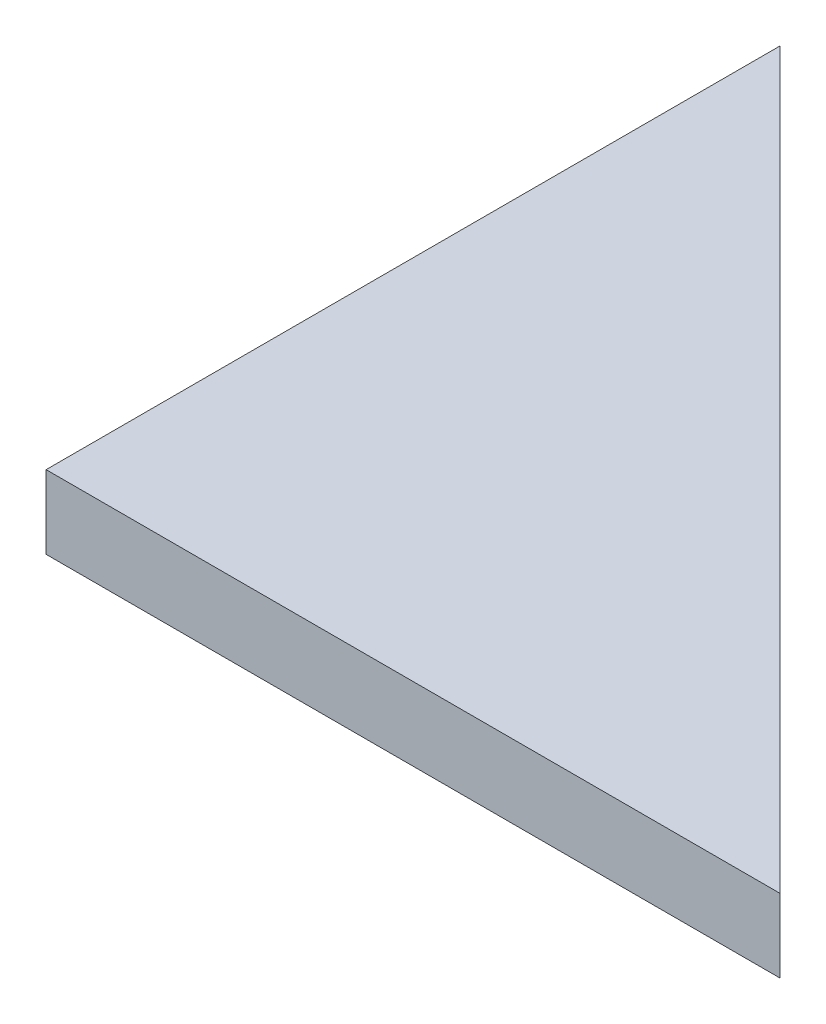
ISO-10303-21;
HEADER;
FILE_DESCRIPTION(('STEP AP214'),'2;1');
FILE_NAME('part.step','',(''),(''),'','','');
FILE_SCHEMA(('AUTOMOTIVE_DESIGN { 1 0 10303 214 1 1 1 1 }'));
ENDSEC;
DATA;
#1=APPLICATION_CONTEXT('core data for automotive mechanical design processes');
#2=APPLICATION_PROTOCOL_DEFINITION('international standard','automotive_design',2000,#1);
#3=PRODUCT_CONTEXT('',#1,'mechanical');
#4=PRODUCT('Part','Part','',(#3));
#5=PRODUCT_RELATED_PRODUCT_CATEGORY('part','',(#4));
#6=PRODUCT_DEFINITION_FORMATION('','',#4);
#7=PRODUCT_DEFINITION_CONTEXT('part definition',#1,'design');
#8=PRODUCT_DEFINITION('design','',#6,#7);
#9=PRODUCT_DEFINITION_SHAPE('','',#8);
#10=(LENGTH_UNIT() NAMED_UNIT(*) SI_UNIT(.MILLI.,.METRE.));
#11=(NAMED_UNIT(*) PLANE_ANGLE_UNIT() SI_UNIT($,.RADIAN.));
#12=(NAMED_UNIT(*) SI_UNIT($,.STERADIAN.) SOLID_ANGLE_UNIT());
#13=UNCERTAINTY_MEASURE_WITH_UNIT(LENGTH_MEASURE(1.E-05),#10,'distance_accuracy_value','');
#14=(GEOMETRIC_REPRESENTATION_CONTEXT(3) GLOBAL_UNCERTAINTY_ASSIGNED_CONTEXT((#13)) GLOBAL_UNIT_ASSIGNED_CONTEXT((#10,
#11,#12)) REPRESENTATION_CONTEXT('',''));
#15=CARTESIAN_POINT('',(0.,0.,0.));
#16=DIRECTION('',(0.,0.,1.));
#17=DIRECTION('',(1.,0.,0.));
#18=AXIS2_PLACEMENT_3D('',#15,#16,#17);
#19=CARTESIAN_POINT('',(50.,5.,0.));
#20=DIRECTION('',(0.,0.,-1.));
#21=DIRECTION('',(-1.,0.,0.));
#22=AXIS2_PLACEMENT_3D('',#19,#20,#21);
#23=PLANE('',#22);
#24=DIRECTION('',(1.,0.,0.));
#25=VECTOR('',#24,1.);
#26=CARTESIAN_POINT('',(50.,0.,0.));
#27=LINE('',#26,#25);
#28=CARTESIAN_POINT('',(0.,0.,0.));
#29=VERTEX_POINT('',#28);
#30=CARTESIAN_POINT('',(50.,0.,0.));
#31=VERTEX_POINT('',#30);
#32=EDGE_CURVE('E80',#29,#31,#27,.T.);
#33=ORIENTED_EDGE('',*,*,#32,.T.);
#34=DIRECTION('',(0.,-1.,0.));
#35=VECTOR('',#34,1.);
#36=CARTESIAN_POINT('',(50.,5.,0.));
#37=LINE('',#36,#35);
#38=CARTESIAN_POINT('',(50.,5.,0.));
#39=VERTEX_POINT('',#38);
#40=EDGE_CURVE('E11',#39,#31,#37,.T.);
#41=ORIENTED_EDGE('',*,*,#40,.F.);
#42=DIRECTION('',(1.,0.,0.));
#43=VECTOR('',#42,1.);
#44=CARTESIAN_POINT('',(50.,5.,0.));
#45=LINE('',#44,#43);
#46=CARTESIAN_POINT('',(0.,5.,0.));
#47=VERTEX_POINT('',#46);
#48=EDGE_CURVE('E73',#47,#39,#45,.T.);
#49=ORIENTED_EDGE('',*,*,#48,.F.);
#50=DIRECTION('',(0.,-1.,0.));
#51=VECTOR('',#50,1.);
#52=CARTESIAN_POINT('',(0.,5.,0.));
#53=LINE('',#52,#51);
#54=EDGE_CURVE('E81',#47,#29,#53,.T.);
#55=ORIENTED_EDGE('',*,*,#54,.T.);
#56=EDGE_LOOP('',(#33,#41,#49,#55));
#57=FACE_BOUND('',#56,.T.);
#58=ADVANCED_FACE('F33',(#57),#23,.F.);
#59=CARTESIAN_POINT('',(0.,5.,-50.));
#60=DIRECTION('',(-0.707106781186548,0.,0.707106781186548));
#61=DIRECTION('',(0.707106781186548,0.,0.707106781186548));
#62=AXIS2_PLACEMENT_3D('',#59,#60,#61);
#63=PLANE('',#62);
#64=DIRECTION('',(-0.707106781186547,0.,-0.707106781186547));
#65=VECTOR('',#64,1.);
#66=CARTESIAN_POINT('',(0.,0.,-50.));
#67=LINE('',#66,#65);
#68=CARTESIAN_POINT('',(0.,0.,-50.));
#69=VERTEX_POINT('',#68);
#70=EDGE_CURVE('E61',#31,#69,#67,.T.);
#71=ORIENTED_EDGE('',*,*,#70,.T.);
#72=DIRECTION('',(0.,-1.,0.));
#73=VECTOR('',#72,1.);
#74=CARTESIAN_POINT('',(0.,5.,-50.));
#75=LINE('',#74,#73);
#76=CARTESIAN_POINT('',(0.,5.,-50.));
#77=VERTEX_POINT('',#76);
#78=EDGE_CURVE('E41',#77,#69,#75,.T.);
#79=ORIENTED_EDGE('',*,*,#78,.F.);
#80=DIRECTION('',(-0.707106781186547,0.,-0.707106781186547));
#81=VECTOR('',#80,1.);
#82=CARTESIAN_POINT('',(0.,5.,-50.));
#83=LINE('',#82,#81);
#84=EDGE_CURVE('E69',#39,#77,#83,.T.);
#85=ORIENTED_EDGE('',*,*,#84,.F.);
#86=ORIENTED_EDGE('',*,*,#40,.T.);
#87=EDGE_LOOP('',(#71,#79,#85,#86));
#88=FACE_BOUND('',#87,.T.);
#89=ADVANCED_FACE('F70',(#88),#63,.F.);
#90=CARTESIAN_POINT('',(0.,5.,0.));
#91=DIRECTION('',(1.,0.,0.));
#92=DIRECTION('',(0.,0.,-1.));
#93=AXIS2_PLACEMENT_3D('',#90,#91,#92);
#94=PLANE('',#93);
#95=DIRECTION('',(0.,0.,1.));
#96=VECTOR('',#95,1.);
#97=CARTESIAN_POINT('',(0.,0.,0.));
#98=LINE('',#97,#96);
#99=EDGE_CURVE('E66',#69,#29,#98,.T.);
#100=ORIENTED_EDGE('',*,*,#99,.T.);
#101=ORIENTED_EDGE('',*,*,#54,.F.);
#102=DIRECTION('',(0.,0.,1.));
#103=VECTOR('',#102,1.);
#104=CARTESIAN_POINT('',(0.,5.,0.));
#105=LINE('',#104,#103);
#106=EDGE_CURVE('E49',#77,#47,#105,.T.);
#107=ORIENTED_EDGE('',*,*,#106,.F.);
#108=ORIENTED_EDGE('',*,*,#78,.T.);
#109=EDGE_LOOP('',(#100,#101,#107,#108));
#110=FACE_BOUND('',#109,.T.);
#111=ADVANCED_FACE('F88',(#110),#94,.F.);
#112=CARTESIAN_POINT('',(0.,5.,0.));
#113=DIRECTION('',(0.,-1.,0.));
#114=DIRECTION('',(0.,0.,-1.));
#115=AXIS2_PLACEMENT_3D('',#112,#113,#114);
#116=PLANE('',#115);
#117=ORIENTED_EDGE('',*,*,#48,.T.);
#118=ORIENTED_EDGE('',*,*,#84,.T.);
#119=ORIENTED_EDGE('',*,*,#106,.T.);
#120=EDGE_LOOP('',(#117,#118,#119));
#121=FACE_BOUND('',#120,.T.);
#122=ADVANCED_FACE('F76',(#121),#116,.F.);
#123=CARTESIAN_POINT('',(0.,0.,0.));
#124=DIRECTION('',(0.,-1.,0.));
#125=DIRECTION('',(0.,0.,-1.));
#126=AXIS2_PLACEMENT_3D('',#123,#124,#125);
#127=PLANE('',#126);
#128=ORIENTED_EDGE('',*,*,#32,.F.);
#129=ORIENTED_EDGE('',*,*,#99,.F.);
#130=ORIENTED_EDGE('',*,*,#70,.F.);
#131=EDGE_LOOP('',(#128,#129,#130));
#132=FACE_BOUND('',#131,.T.);
#133=ADVANCED_FACE('F89',(#132),#127,.T.);
#134=CLOSED_SHELL('',(#58,#89,#111,#122,#133));
#135=MANIFOLD_SOLID_BREP('B2',#134);
#136=ADVANCED_BREP_SHAPE_REPRESENTATION('',(#18,#135),#14);
#137=SHAPE_DEFINITION_REPRESENTATION(#9,#136);
ENDSEC;
END-ISO-10303-21;
